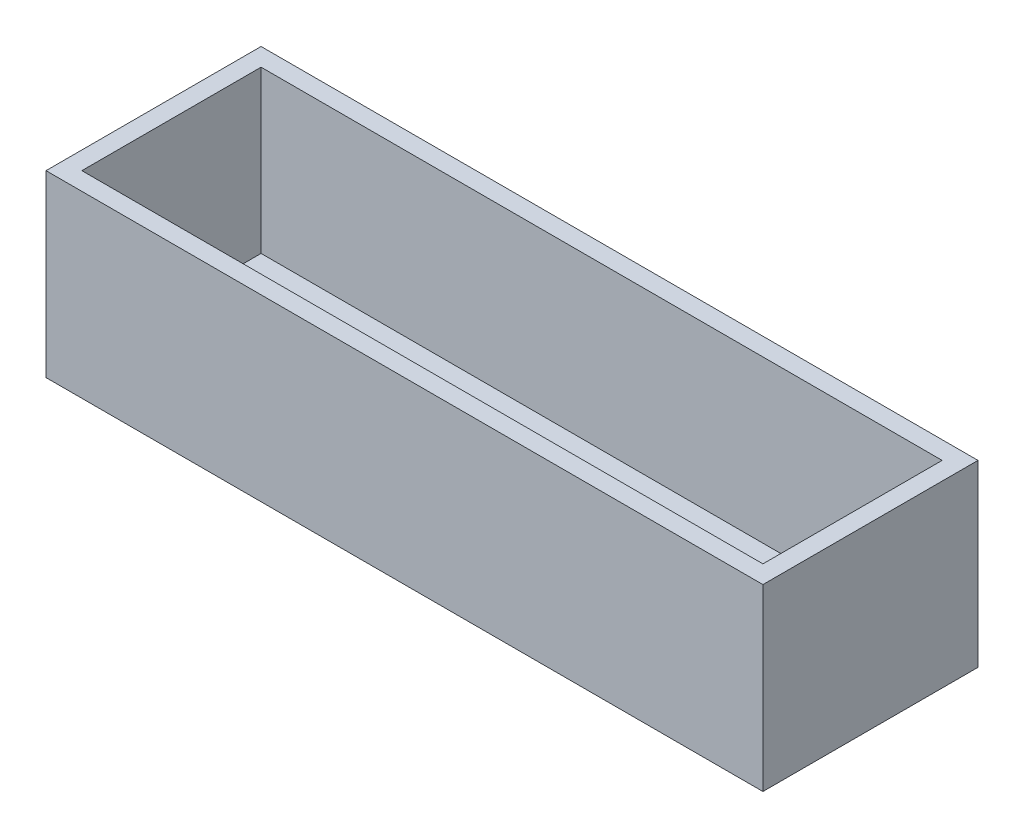
ISO-10303-21;
HEADER;
FILE_DESCRIPTION(('STEP AP214'),'2;1');
FILE_NAME('part.step','',(''),(''),'','','');
FILE_SCHEMA(('AUTOMOTIVE_DESIGN { 1 0 10303 214 1 1 1 1 }'));
ENDSEC;
DATA;
#1=APPLICATION_CONTEXT('core data for automotive mechanical design processes');
#2=APPLICATION_PROTOCOL_DEFINITION('international standard','automotive_design',2000,#1);
#3=PRODUCT_CONTEXT('',#1,'mechanical');
#4=PRODUCT('Part','Part','',(#3));
#5=PRODUCT_RELATED_PRODUCT_CATEGORY('part','',(#4));
#6=PRODUCT_DEFINITION_FORMATION('','',#4);
#7=PRODUCT_DEFINITION_CONTEXT('part definition',#1,'design');
#8=PRODUCT_DEFINITION('design','',#6,#7);
#9=PRODUCT_DEFINITION_SHAPE('','',#8);
#10=(LENGTH_UNIT() NAMED_UNIT(*) SI_UNIT(.MILLI.,.METRE.));
#11=(NAMED_UNIT(*) PLANE_ANGLE_UNIT() SI_UNIT($,.RADIAN.));
#12=(NAMED_UNIT(*) SI_UNIT($,.STERADIAN.) SOLID_ANGLE_UNIT());
#13=UNCERTAINTY_MEASURE_WITH_UNIT(LENGTH_MEASURE(1.E-05),#10,'distance_accuracy_value','');
#14=(GEOMETRIC_REPRESENTATION_CONTEXT(3) GLOBAL_UNCERTAINTY_ASSIGNED_CONTEXT((#13)) GLOBAL_UNIT_ASSIGNED_CONTEXT((#10,
#11,#12)) REPRESENTATION_CONTEXT('',''));
#15=CARTESIAN_POINT('',(0.,0.,0.));
#16=DIRECTION('',(0.,0.,1.));
#17=DIRECTION('',(1.,0.,0.));
#18=AXIS2_PLACEMENT_3D('',#15,#16,#17);
#19=CARTESIAN_POINT('',(0.,50.,0.));
#20=DIRECTION('',(0.,-1.,0.));
#21=DIRECTION('',(0.,0.,-1.));
#22=AXIS2_PLACEMENT_3D('',#19,#20,#21);
#23=PLANE('',#22);
#24=DIRECTION('',(0.,0.,1.));
#25=VECTOR('',#24,1.);
#26=CARTESIAN_POINT('',(0.,50.,0.));
#27=LINE('',#26,#25);
#28=CARTESIAN_POINT('',(0.,50.,-60.));
#29=VERTEX_POINT('',#28);
#30=CARTESIAN_POINT('',(0.,50.,0.));
#31=VERTEX_POINT('',#30);
#32=EDGE_CURVE('E141',#29,#31,#27,.T.);
#33=ORIENTED_EDGE('',*,*,#32,.T.);
#34=DIRECTION('',(1.,0.,0.));
#35=VECTOR('',#34,1.);
#36=CARTESIAN_POINT('',(0.,50.,0.));
#37=LINE('',#36,#35);
#38=CARTESIAN_POINT('',(200.,50.,0.));
#39=VERTEX_POINT('',#38);
#40=EDGE_CURVE('E85',#31,#39,#37,.T.);
#41=ORIENTED_EDGE('',*,*,#40,.T.);
#42=DIRECTION('',(0.,0.,-1.));
#43=VECTOR('',#42,1.);
#44=CARTESIAN_POINT('',(200.,50.,0.));
#45=LINE('',#44,#43);
#46=CARTESIAN_POINT('',(200.,50.,-60.));
#47=VERTEX_POINT('',#46);
#48=EDGE_CURVE('E144',#39,#47,#45,.T.);
#49=ORIENTED_EDGE('',*,*,#48,.T.);
#50=DIRECTION('',(-1.,0.,0.));
#51=VECTOR('',#50,1.);
#52=CARTESIAN_POINT('',(0.,50.,-60.));
#53=LINE('',#52,#51);
#54=EDGE_CURVE('E57',#47,#29,#53,.T.);
#55=ORIENTED_EDGE('',*,*,#54,.T.);
#56=EDGE_LOOP('',(#33,#41,#49,#55));
#57=FACE_BOUND('',#56,.T.);
#58=DIRECTION('',(0.,0.,1.));
#59=VECTOR('',#58,1.);
#60=CARTESIAN_POINT('',(5.,50.,0.));
#61=LINE('',#60,#59);
#62=CARTESIAN_POINT('',(5.,50.,-55.));
#63=VERTEX_POINT('',#62);
#64=CARTESIAN_POINT('',(5.,50.,-5.));
#65=VERTEX_POINT('',#64);
#66=EDGE_CURVE('E130',#63,#65,#61,.T.);
#67=ORIENTED_EDGE('',*,*,#66,.F.);
#68=DIRECTION('',(-1.,0.,0.));
#69=VECTOR('',#68,1.);
#70=CARTESIAN_POINT('',(0.,50.,-55.));
#71=LINE('',#70,#69);
#72=CARTESIAN_POINT('',(195.,50.,-55.));
#73=VERTEX_POINT('',#72);
#74=EDGE_CURVE('E139',#73,#63,#71,.T.);
#75=ORIENTED_EDGE('',*,*,#74,.F.);
#76=DIRECTION('',(0.,0.,-1.));
#77=VECTOR('',#76,1.);
#78=CARTESIAN_POINT('',(195.,50.,0.));
#79=LINE('',#78,#77);
#80=CARTESIAN_POINT('',(195.,50.,-5.));
#81=VERTEX_POINT('',#80);
#82=EDGE_CURVE('E137',#81,#73,#79,.T.);
#83=ORIENTED_EDGE('',*,*,#82,.F.);
#84=DIRECTION('',(1.,0.,0.));
#85=VECTOR('',#84,1.);
#86=CARTESIAN_POINT('',(0.,50.,-5.));
#87=LINE('',#86,#85);
#88=EDGE_CURVE('E122',#65,#81,#87,.T.);
#89=ORIENTED_EDGE('',*,*,#88,.F.);
#90=EDGE_LOOP('',(#67,#75,#83,#89));
#91=FACE_BOUND('',#90,.T.);
#92=ADVANCED_FACE('F33',(#57,#91),#23,.F.);
#93=CARTESIAN_POINT('',(0.,50.,0.));
#94=DIRECTION('',(1.,0.,0.));
#95=DIRECTION('',(0.,0.,-1.));
#96=AXIS2_PLACEMENT_3D('',#93,#94,#95);
#97=PLANE('',#96);
#98=DIRECTION('',(0.,0.,1.));
#99=VECTOR('',#98,1.);
#100=CARTESIAN_POINT('',(0.,0.,0.));
#101=LINE('',#100,#99);
#102=CARTESIAN_POINT('',(0.,0.,-60.));
#103=VERTEX_POINT('',#102);
#104=CARTESIAN_POINT('',(0.,0.,0.));
#105=VERTEX_POINT('',#104);
#106=EDGE_CURVE('E148',#103,#105,#101,.T.);
#107=ORIENTED_EDGE('',*,*,#106,.T.);
#108=DIRECTION('',(0.,-1.,0.));
#109=VECTOR('',#108,1.);
#110=CARTESIAN_POINT('',(0.,50.,0.));
#111=LINE('',#110,#109);
#112=EDGE_CURVE('E11',#31,#105,#111,.T.);
#113=ORIENTED_EDGE('',*,*,#112,.F.);
#114=ORIENTED_EDGE('',*,*,#32,.F.);
#115=DIRECTION('',(0.,-1.,0.));
#116=VECTOR('',#115,1.);
#117=CARTESIAN_POINT('',(0.,50.,-60.));
#118=LINE('',#117,#116);
#119=EDGE_CURVE('E147',#29,#103,#118,.T.);
#120=ORIENTED_EDGE('',*,*,#119,.T.);
#121=EDGE_LOOP('',(#107,#113,#114,#120));
#122=FACE_BOUND('',#121,.T.);
#123=ADVANCED_FACE('F35',(#122),#97,.F.);
#124=CARTESIAN_POINT('',(0.,50.,0.));
#125=DIRECTION('',(0.,0.,-1.));
#126=DIRECTION('',(-1.,0.,0.));
#127=AXIS2_PLACEMENT_3D('',#124,#125,#126);
#128=PLANE('',#127);
#129=DIRECTION('',(1.,0.,0.));
#130=VECTOR('',#129,1.);
#131=CARTESIAN_POINT('',(0.,0.,0.));
#132=LINE('',#131,#130);
#133=CARTESIAN_POINT('',(200.,0.,0.));
#134=VERTEX_POINT('',#133);
#135=EDGE_CURVE('E151',#105,#134,#132,.T.);
#136=ORIENTED_EDGE('',*,*,#135,.T.);
#137=DIRECTION('',(0.,-1.,0.));
#138=VECTOR('',#137,1.);
#139=CARTESIAN_POINT('',(200.,50.,0.));
#140=LINE('',#139,#138);
#141=EDGE_CURVE('E41',#39,#134,#140,.T.);
#142=ORIENTED_EDGE('',*,*,#141,.F.);
#143=ORIENTED_EDGE('',*,*,#40,.F.);
#144=ORIENTED_EDGE('',*,*,#112,.T.);
#145=EDGE_LOOP('',(#136,#142,#143,#144));
#146=FACE_BOUND('',#145,.T.);
#147=ADVANCED_FACE('F179',(#146),#128,.F.);
#148=CARTESIAN_POINT('',(200.,50.,0.));
#149=DIRECTION('',(-1.,0.,0.));
#150=DIRECTION('',(0.,0.,1.));
#151=AXIS2_PLACEMENT_3D('',#148,#149,#150);
#152=PLANE('',#151);
#153=DIRECTION('',(0.,0.,-1.));
#154=VECTOR('',#153,1.);
#155=CARTESIAN_POINT('',(200.,0.,0.));
#156=LINE('',#155,#154);
#157=CARTESIAN_POINT('',(200.,0.,-60.));
#158=VERTEX_POINT('',#157);
#159=EDGE_CURVE('E153',#134,#158,#156,.T.);
#160=ORIENTED_EDGE('',*,*,#159,.T.);
#161=DIRECTION('',(0.,-1.,0.));
#162=VECTOR('',#161,1.);
#163=CARTESIAN_POINT('',(200.,50.,-60.));
#164=LINE('',#163,#162);
#165=EDGE_CURVE('E157',#47,#158,#164,.T.);
#166=ORIENTED_EDGE('',*,*,#165,.F.);
#167=ORIENTED_EDGE('',*,*,#48,.F.);
#168=ORIENTED_EDGE('',*,*,#141,.T.);
#169=EDGE_LOOP('',(#160,#166,#167,#168));
#170=FACE_BOUND('',#169,.T.);
#171=ADVANCED_FACE('F162',(#170),#152,.F.);
#172=CARTESIAN_POINT('',(0.,50.,-60.));
#173=DIRECTION('',(0.,0.,1.));
#174=DIRECTION('',(1.,0.,0.));
#175=AXIS2_PLACEMENT_3D('',#172,#173,#174);
#176=PLANE('',#175);
#177=DIRECTION('',(-1.,0.,0.));
#178=VECTOR('',#177,1.);
#179=CARTESIAN_POINT('',(0.,0.,-60.));
#180=LINE('',#179,#178);
#181=EDGE_CURVE('E78',#158,#103,#180,.T.);
#182=ORIENTED_EDGE('',*,*,#181,.T.);
#183=ORIENTED_EDGE('',*,*,#119,.F.);
#184=ORIENTED_EDGE('',*,*,#54,.F.);
#185=ORIENTED_EDGE('',*,*,#165,.T.);
#186=EDGE_LOOP('',(#182,#183,#184,#185));
#187=FACE_BOUND('',#186,.T.);
#188=ADVANCED_FACE('F170',(#187),#176,.F.);
#189=CARTESIAN_POINT('',(0.,0.,0.));
#190=DIRECTION('',(0.,-1.,0.));
#191=DIRECTION('',(0.,0.,-1.));
#192=AXIS2_PLACEMENT_3D('',#189,#190,#191);
#193=PLANE('',#192);
#194=ORIENTED_EDGE('',*,*,#106,.F.);
#195=ORIENTED_EDGE('',*,*,#181,.F.);
#196=ORIENTED_EDGE('',*,*,#159,.F.);
#197=ORIENTED_EDGE('',*,*,#135,.F.);
#198=EDGE_LOOP('',(#194,#195,#196,#197));
#199=FACE_BOUND('',#198,.T.);
#200=ADVANCED_FACE('F166',(#199),#193,.T.);
#201=CARTESIAN_POINT('',(5.,50.,0.));
#202=DIRECTION('',(1.,0.,0.));
#203=DIRECTION('',(0.,0.,-1.));
#204=AXIS2_PLACEMENT_3D('',#201,#202,#203);
#205=PLANE('',#204);
#206=DIRECTION('',(0.,0.,1.));
#207=VECTOR('',#206,1.);
#208=CARTESIAN_POINT('',(5.,5.,0.));
#209=LINE('',#208,#207);
#210=CARTESIAN_POINT('',(5.,5.,-55.));
#211=VERTEX_POINT('',#210);
#212=CARTESIAN_POINT('',(5.,5.,-5.));
#213=VERTEX_POINT('',#212);
#214=EDGE_CURVE('E113',#211,#213,#209,.T.);
#215=ORIENTED_EDGE('',*,*,#214,.F.);
#216=DIRECTION('',(0.,-1.,0.));
#217=VECTOR('',#216,1.);
#218=CARTESIAN_POINT('',(5.,50.,-55.));
#219=LINE('',#218,#217);
#220=EDGE_CURVE('E133',#63,#211,#219,.T.);
#221=ORIENTED_EDGE('',*,*,#220,.F.);
#222=ORIENTED_EDGE('',*,*,#66,.T.);
#223=DIRECTION('',(0.,-1.,0.));
#224=VECTOR('',#223,1.);
#225=CARTESIAN_POINT('',(5.,50.,-5.));
#226=LINE('',#225,#224);
#227=EDGE_CURVE('E125',#65,#213,#226,.T.);
#228=ORIENTED_EDGE('',*,*,#227,.T.);
#229=EDGE_LOOP('',(#215,#221,#222,#228));
#230=FACE_BOUND('',#229,.T.);
#231=ADVANCED_FACE('F177',(#230),#205,.T.);
#232=CARTESIAN_POINT('',(0.,50.,-5.));
#233=DIRECTION('',(0.,0.,-1.));
#234=DIRECTION('',(-1.,0.,0.));
#235=AXIS2_PLACEMENT_3D('',#232,#233,#234);
#236=PLANE('',#235);
#237=DIRECTION('',(1.,0.,0.));
#238=VECTOR('',#237,1.);
#239=CARTESIAN_POINT('',(0.,5.,-5.));
#240=LINE('',#239,#238);
#241=CARTESIAN_POINT('',(195.,5.,-5.));
#242=VERTEX_POINT('',#241);
#243=EDGE_CURVE('E107',#213,#242,#240,.T.);
#244=ORIENTED_EDGE('',*,*,#243,.F.);
#245=ORIENTED_EDGE('',*,*,#227,.F.);
#246=ORIENTED_EDGE('',*,*,#88,.T.);
#247=DIRECTION('',(0.,-1.,0.));
#248=VECTOR('',#247,1.);
#249=CARTESIAN_POINT('',(195.,50.,-5.));
#250=LINE('',#249,#248);
#251=EDGE_CURVE('E119',#81,#242,#250,.T.);
#252=ORIENTED_EDGE('',*,*,#251,.T.);
#253=EDGE_LOOP('',(#244,#245,#246,#252));
#254=FACE_BOUND('',#253,.T.);
#255=ADVANCED_FACE('F120',(#254),#236,.T.);
#256=CARTESIAN_POINT('',(195.,50.,0.));
#257=DIRECTION('',(-1.,0.,0.));
#258=DIRECTION('',(0.,0.,1.));
#259=AXIS2_PLACEMENT_3D('',#256,#257,#258);
#260=PLANE('',#259);
#261=DIRECTION('',(0.,0.,-1.));
#262=VECTOR('',#261,1.);
#263=CARTESIAN_POINT('',(195.,5.,0.));
#264=LINE('',#263,#262);
#265=CARTESIAN_POINT('',(195.,5.,-55.));
#266=VERTEX_POINT('',#265);
#267=EDGE_CURVE('E111',#242,#266,#264,.T.);
#268=ORIENTED_EDGE('',*,*,#267,.F.);
#269=ORIENTED_EDGE('',*,*,#251,.F.);
#270=ORIENTED_EDGE('',*,*,#82,.T.);
#271=DIRECTION('',(0.,-1.,0.));
#272=VECTOR('',#271,1.);
#273=CARTESIAN_POINT('',(195.,50.,-55.));
#274=LINE('',#273,#272);
#275=EDGE_CURVE('E48',#73,#266,#274,.T.);
#276=ORIENTED_EDGE('',*,*,#275,.T.);
#277=EDGE_LOOP('',(#268,#269,#270,#276));
#278=FACE_BOUND('',#277,.T.);
#279=ADVANCED_FACE('F127',(#278),#260,.T.);
#280=CARTESIAN_POINT('',(0.,50.,-55.));
#281=DIRECTION('',(0.,0.,1.));
#282=DIRECTION('',(1.,0.,0.));
#283=AXIS2_PLACEMENT_3D('',#280,#281,#282);
#284=PLANE('',#283);
#285=DIRECTION('',(-1.,0.,0.));
#286=VECTOR('',#285,1.);
#287=CARTESIAN_POINT('',(0.,5.,-55.));
#288=LINE('',#287,#286);
#289=EDGE_CURVE('E128',#266,#211,#288,.T.);
#290=ORIENTED_EDGE('',*,*,#289,.F.);
#291=ORIENTED_EDGE('',*,*,#275,.F.);
#292=ORIENTED_EDGE('',*,*,#74,.T.);
#293=ORIENTED_EDGE('',*,*,#220,.T.);
#294=EDGE_LOOP('',(#290,#291,#292,#293));
#295=FACE_BOUND('',#294,.T.);
#296=ADVANCED_FACE('F190',(#295),#284,.T.);
#297=CARTESIAN_POINT('',(0.,5.,0.));
#298=DIRECTION('',(0.,-1.,0.));
#299=DIRECTION('',(0.,0.,-1.));
#300=AXIS2_PLACEMENT_3D('',#297,#298,#299);
#301=PLANE('',#300);
#302=ORIENTED_EDGE('',*,*,#214,.T.);
#303=ORIENTED_EDGE('',*,*,#243,.T.);
#304=ORIENTED_EDGE('',*,*,#267,.T.);
#305=ORIENTED_EDGE('',*,*,#289,.T.);
#306=EDGE_LOOP('',(#302,#303,#304,#305));
#307=FACE_BOUND('',#306,.T.);
#308=ADVANCED_FACE('F109',(#307),#301,.F.);
#309=CLOSED_SHELL('',(#92,#123,#147,#171,#188,#200,#231,#255,#279,#296,#308));
#310=MANIFOLD_SOLID_BREP('B2',#309);
#311=ADVANCED_BREP_SHAPE_REPRESENTATION('',(#18,#310),#14);
#312=SHAPE_DEFINITION_REPRESENTATION(#9,#311);
ENDSEC;
END-ISO-10303-21;
